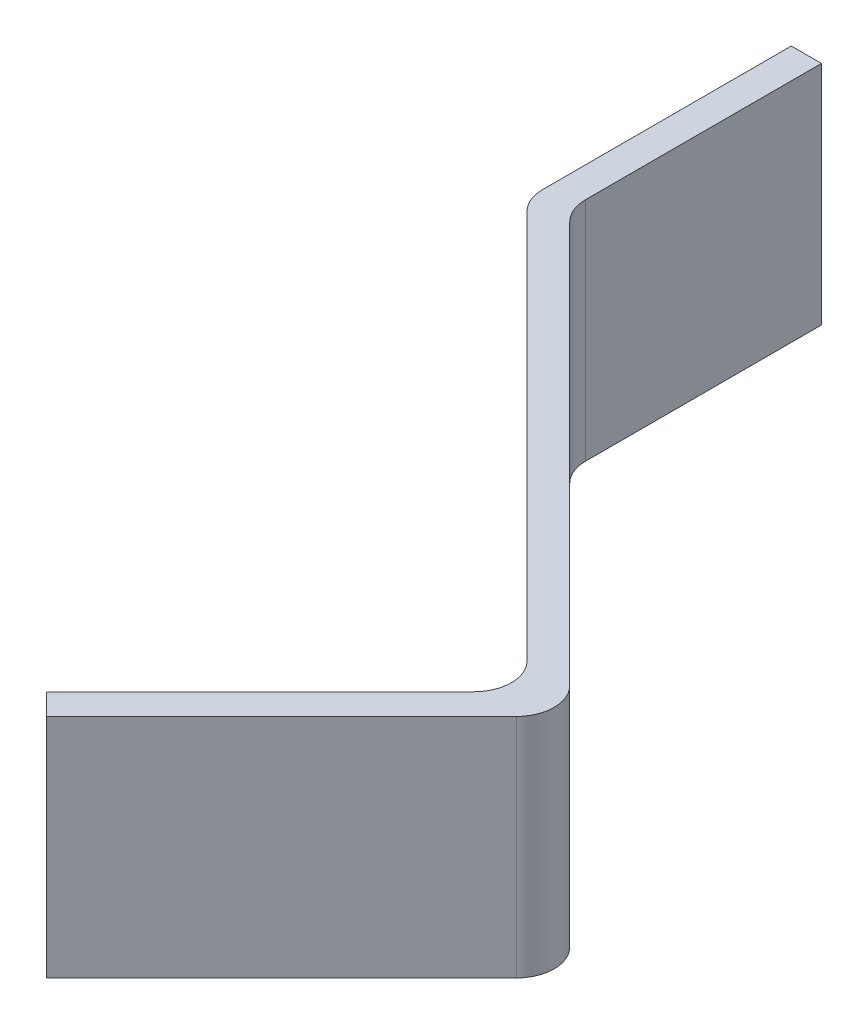
ISO-10303-21;
HEADER;
FILE_DESCRIPTION(('STEP AP214'),'2;1');
FILE_NAME('part.step','',(''),(''),'','','');
FILE_SCHEMA(('AUTOMOTIVE_DESIGN { 1 0 10303 214 1 1 1 1 }'));
ENDSEC;
DATA;
#1=APPLICATION_CONTEXT('core data for automotive mechanical design processes');
#2=APPLICATION_PROTOCOL_DEFINITION('international standard','automotive_design',2000,#1);
#3=PRODUCT_CONTEXT('',#1,'mechanical');
#4=PRODUCT('Part','Part','',(#3));
#5=PRODUCT_RELATED_PRODUCT_CATEGORY('part','',(#4));
#6=PRODUCT_DEFINITION_FORMATION('','',#4);
#7=PRODUCT_DEFINITION_CONTEXT('part definition',#1,'design');
#8=PRODUCT_DEFINITION('design','',#6,#7);
#9=PRODUCT_DEFINITION_SHAPE('','',#8);
#10=(LENGTH_UNIT() NAMED_UNIT(*) SI_UNIT(.MILLI.,.METRE.));
#11=(NAMED_UNIT(*) PLANE_ANGLE_UNIT() SI_UNIT($,.RADIAN.));
#12=(NAMED_UNIT(*) SI_UNIT($,.STERADIAN.) SOLID_ANGLE_UNIT());
#13=UNCERTAINTY_MEASURE_WITH_UNIT(LENGTH_MEASURE(1.E-05),#10,'distance_accuracy_value','');
#14=(GEOMETRIC_REPRESENTATION_CONTEXT(3) GLOBAL_UNCERTAINTY_ASSIGNED_CONTEXT((#13)) GLOBAL_UNIT_ASSIGNED_CONTEXT((#10,
#11,#12)) REPRESENTATION_CONTEXT('',''));
#15=CARTESIAN_POINT('',(0.,0.,0.));
#16=DIRECTION('',(0.,0.,1.));
#17=DIRECTION('',(1.,0.,0.));
#18=AXIS2_PLACEMENT_3D('',#15,#16,#17);
#19=CARTESIAN_POINT('',(245.256587827418,-22.5,-1.64112144396712));
#20=DIRECTION('',(0.,1.,0.));
#21=DIRECTION('',(0.,0.,1.));
#22=AXIS2_PLACEMENT_3D('',#19,#20,#21);
#23=CYLINDRICAL_SURFACE('',#22,4.99999999999998);
#24=CARTESIAN_POINT('',(245.256587827418,7.5,-1.64112144396712));
#25=DIRECTION('',(0.,1.,0.));
#26=DIRECTION('',(0.,0.,1.));
#27=AXIS2_PLACEMENT_3D('',#24,#25,#26);
#28=CIRCLE('',#27,4.99999999999998);
#29=CARTESIAN_POINT('',(248.79212173335,7.5,1.8944124619657));
#30=VERTEX_POINT('',#29);
#31=CARTESIAN_POINT('',(248.79212173335,7.5,-5.17665534989981));
#32=VERTEX_POINT('',#31);
#33=EDGE_CURVE('E154',#30,#32,#28,.T.);
#34=ORIENTED_EDGE('',*,*,#33,.F.);
#35=DIRECTION('',(0.,1.,0.));
#36=VECTOR('',#35,1.);
#37=CARTESIAN_POINT('',(248.79212173335,-22.5,1.8944124619657));
#38=LINE('',#37,#36);
#39=CARTESIAN_POINT('',(248.79212173335,-22.5,1.8944124619657));
#40=VERTEX_POINT('',#39);
#41=EDGE_CURVE('E11',#40,#30,#38,.T.);
#42=ORIENTED_EDGE('',*,*,#41,.F.);
#43=CARTESIAN_POINT('',(245.256587827418,-22.5,-1.64112144396712));
#44=DIRECTION('',(0.,1.,0.));
#45=DIRECTION('',(0.,0.,1.));
#46=AXIS2_PLACEMENT_3D('',#43,#44,#45);
#47=CIRCLE('',#46,4.99999999999998);
#48=CARTESIAN_POINT('',(248.79212173335,-22.5,-5.17665534989981));
#49=VERTEX_POINT('',#48);
#50=EDGE_CURVE('E186',#40,#49,#47,.T.);
#51=ORIENTED_EDGE('',*,*,#50,.T.);
#52=DIRECTION('',(0.,1.,0.));
#53=VECTOR('',#52,1.);
#54=CARTESIAN_POINT('',(248.79212173335,-22.5,-5.17665534989981));
#55=LINE('',#54,#53);
#56=EDGE_CURVE('E36',#49,#32,#55,.T.);
#57=ORIENTED_EDGE('',*,*,#56,.T.);
#58=EDGE_LOOP('',(#34,#42,#51,#57));
#59=FACE_BOUND('',#58,.T.);
#60=ADVANCED_FACE('F33',(#59),#23,.T.);
#61=CARTESIAN_POINT('',(217.679423361142,-22.5,33.007110834174));
#62=DIRECTION('',(0.70710678118655,0.,0.707106781186545));
#63=DIRECTION('',(0.707106781186545,0.,-0.70710678118655));
#64=AXIS2_PLACEMENT_3D('',#61,#62,#63);
#65=PLANE('',#64);
#66=DIRECTION('',(0.707106781186545,0.,-0.70710678118655));
#67=VECTOR('',#66,1.);
#68=CARTESIAN_POINT('',(217.679423361142,7.5,33.007110834174));
#69=LINE('',#68,#67);
#70=CARTESIAN_POINT('',(217.679423361142,7.5,33.007110834174));
#71=VERTEX_POINT('',#70);
#72=EDGE_CURVE('E184',#71,#30,#69,.T.);
#73=ORIENTED_EDGE('',*,*,#72,.F.);
#74=DIRECTION('',(0.,1.,0.));
#75=VECTOR('',#74,1.);
#76=CARTESIAN_POINT('',(217.679423361142,-22.5,33.007110834174));
#77=LINE('',#76,#75);
#78=CARTESIAN_POINT('',(217.679423361142,-22.5,33.007110834174));
#79=VERTEX_POINT('',#78);
#80=EDGE_CURVE('E42',#79,#71,#77,.T.);
#81=ORIENTED_EDGE('',*,*,#80,.F.);
#82=DIRECTION('',(0.707106781186545,0.,-0.70710678118655));
#83=VECTOR('',#82,1.);
#84=CARTESIAN_POINT('',(217.679423361142,-22.5,33.007110834174));
#85=LINE('',#84,#83);
#86=EDGE_CURVE('E144',#79,#40,#85,.T.);
#87=ORIENTED_EDGE('',*,*,#86,.T.);
#88=ORIENTED_EDGE('',*,*,#41,.T.);
#89=EDGE_LOOP('',(#73,#81,#87,#88));
#90=FACE_BOUND('',#89,.T.);
#91=ADVANCED_FACE('F206',(#90),#65,.T.);
#92=CARTESIAN_POINT('',(214.850996236396,-22.5,30.178683709427));
#93=DIRECTION('',(-0.707106781186648,0.,0.707106781186447));
#94=DIRECTION('',(0.707106781186447,0.,0.707106781186648));
#95=AXIS2_PLACEMENT_3D('',#92,#93,#94);
#96=PLANE('',#95);
#97=DIRECTION('',(0.707106781186447,0.,0.707106781186648));
#98=VECTOR('',#97,1.);
#99=CARTESIAN_POINT('',(214.850996236396,7.5,30.178683709427));
#100=LINE('',#99,#98);
#101=CARTESIAN_POINT('',(214.850996236396,7.5,30.178683709427));
#102=VERTEX_POINT('',#101);
#103=EDGE_CURVE('E131',#102,#71,#100,.T.);
#104=ORIENTED_EDGE('',*,*,#103,.F.);
#105=DIRECTION('',(0.,1.,0.));
#106=VECTOR('',#105,1.);
#107=CARTESIAN_POINT('',(214.850996236396,-22.5,30.178683709427));
#108=LINE('',#107,#106);
#109=CARTESIAN_POINT('',(214.850996236396,-22.5,30.178683709427));
#110=VERTEX_POINT('',#109);
#111=EDGE_CURVE('E126',#110,#102,#108,.T.);
#112=ORIENTED_EDGE('',*,*,#111,.F.);
#113=DIRECTION('',(0.707106781186447,0.,0.707106781186648));
#114=VECTOR('',#113,1.);
#115=CARTESIAN_POINT('',(214.850996236396,-22.5,30.178683709427));
#116=LINE('',#115,#114);
#117=EDGE_CURVE('E129',#110,#79,#116,.T.);
#118=ORIENTED_EDGE('',*,*,#117,.T.);
#119=ORIENTED_EDGE('',*,*,#80,.T.);
#120=EDGE_LOOP('',(#104,#112,#118,#119));
#121=FACE_BOUND('',#120,.T.);
#122=ADVANCED_FACE('F128',(#121),#96,.T.);
#123=CARTESIAN_POINT('',(243.135267483858,-22.5,1.8944124619656));
#124=DIRECTION('',(-0.707106781186541,0.,-0.707106781186554));
#125=DIRECTION('',(-0.707106781186554,0.,0.707106781186541));
#126=AXIS2_PLACEMENT_3D('',#123,#124,#125);
#127=PLANE('',#126);
#128=DIRECTION('',(-0.707106781186554,0.,0.707106781186541));
#129=VECTOR('',#128,1.);
#130=CARTESIAN_POINT('',(243.135267483858,7.5,1.8944124619656));
#131=LINE('',#130,#129);
#132=CARTESIAN_POINT('',(243.135267483858,7.5,1.8944124619656));
#133=VERTEX_POINT('',#132);
#134=EDGE_CURVE('E181',#133,#102,#131,.T.);
#135=ORIENTED_EDGE('',*,*,#134,.F.);
#136=DIRECTION('',(0.,1.,0.));
#137=VECTOR('',#136,1.);
#138=CARTESIAN_POINT('',(243.135267483858,-22.5,1.8944124619656));
#139=LINE('',#138,#137);
#140=CARTESIAN_POINT('',(243.135267483858,-22.5,1.8944124619656));
#141=VERTEX_POINT('',#140);
#142=EDGE_CURVE('E136',#141,#133,#139,.T.);
#143=ORIENTED_EDGE('',*,*,#142,.F.);
#144=DIRECTION('',(-0.707106781186554,0.,0.707106781186541));
#145=VECTOR('',#144,1.);
#146=CARTESIAN_POINT('',(243.135267483858,-22.5,1.8944124619656));
#147=LINE('',#146,#145);
#148=EDGE_CURVE('E142',#141,#110,#147,.T.);
#149=ORIENTED_EDGE('',*,*,#148,.T.);
#150=ORIENTED_EDGE('',*,*,#111,.T.);
#151=EDGE_LOOP('',(#135,#143,#149,#150));
#152=FACE_BOUND('',#151,.T.);
#153=ADVANCED_FACE('F146',(#152),#127,.T.);
#154=CARTESIAN_POINT('',(239.599733577925,-22.5,-1.64112144396712));
#155=DIRECTION('',(0.,1.,0.));
#156=DIRECTION('',(0.,0.,1.));
#157=AXIS2_PLACEMENT_3D('',#154,#155,#156);
#158=CYLINDRICAL_SURFACE('',#157,4.99999999999998);
#159=CARTESIAN_POINT('',(239.599733577925,7.5,-1.64112144396712));
#160=DIRECTION('',(0.,-1.,0.));
#161=DIRECTION('',(0.,0.,1.));
#162=AXIS2_PLACEMENT_3D('',#159,#160,#161);
#163=CIRCLE('',#162,4.99999999999998);
#164=CARTESIAN_POINT('',(243.135267483858,7.5,-5.1766553498998));
#165=VERTEX_POINT('',#164);
#166=EDGE_CURVE('E178',#165,#133,#163,.T.);
#167=ORIENTED_EDGE('',*,*,#166,.F.);
#168=DIRECTION('',(0.,1.,0.));
#169=VECTOR('',#168,1.);
#170=CARTESIAN_POINT('',(243.135267483858,-22.5,-5.1766553498998));
#171=LINE('',#170,#169);
#172=CARTESIAN_POINT('',(243.135267483858,-22.5,-5.1766553498998));
#173=VERTEX_POINT('',#172);
#174=EDGE_CURVE('E190',#173,#165,#171,.T.);
#175=ORIENTED_EDGE('',*,*,#174,.F.);
#176=CARTESIAN_POINT('',(239.599733577925,-22.5,-1.64112144396712));
#177=DIRECTION('',(0.,-1.,0.));
#178=DIRECTION('',(0.,0.,1.));
#179=AXIS2_PLACEMENT_3D('',#176,#177,#178);
#180=CIRCLE('',#179,4.99999999999998);
#181=EDGE_CURVE('E147',#173,#141,#180,.T.);
#182=ORIENTED_EDGE('',*,*,#181,.T.);
#183=ORIENTED_EDGE('',*,*,#142,.T.);
#184=EDGE_LOOP('',(#167,#175,#182,#183));
#185=FACE_BOUND('',#184,.T.);
#186=ADVANCED_FACE('F219',(#185),#158,.F.);
#187=CARTESIAN_POINT('',(191.566724988934,-22.5,-56.7451978448237));
#188=DIRECTION('',(-0.707106781186548,0.,0.707106781186546));
#189=DIRECTION('',(0.707106781186547,0.,0.707106781186549));
#190=AXIS2_PLACEMENT_3D('',#187,#188,#189);
#191=PLANE('',#190);
#192=DIRECTION('',(0.707106781186547,0.,0.707106781186549));
#193=VECTOR('',#192,1.);
#194=CARTESIAN_POINT('',(191.566724988934,7.5,-56.7451978448237));
#195=LINE('',#194,#193);
#196=CARTESIAN_POINT('',(191.566724988934,7.5,-56.7451978448237));
#197=VERTEX_POINT('',#196);
#198=EDGE_CURVE('E175',#197,#165,#195,.T.);
#199=ORIENTED_EDGE('',*,*,#198,.F.);
#200=DIRECTION('',(0.,1.,0.));
#201=VECTOR('',#200,1.);
#202=CARTESIAN_POINT('',(191.566724988934,-22.5,-56.7451978448237));
#203=LINE('',#202,#201);
#204=CARTESIAN_POINT('',(191.566724988934,-22.5,-56.7451978448237));
#205=VERTEX_POINT('',#204);
#206=EDGE_CURVE('E192',#205,#197,#203,.T.);
#207=ORIENTED_EDGE('',*,*,#206,.F.);
#208=DIRECTION('',(0.707106781186547,0.,0.707106781186549));
#209=VECTOR('',#208,1.);
#210=CARTESIAN_POINT('',(191.566724988934,-22.5,-56.7451978448237));
#211=LINE('',#210,#209);
#212=EDGE_CURVE('E149',#205,#173,#211,.T.);
#213=ORIENTED_EDGE('',*,*,#212,.T.);
#214=ORIENTED_EDGE('',*,*,#174,.T.);
#215=EDGE_LOOP('',(#199,#207,#213,#214));
#216=FACE_BOUND('',#215,.T.);
#217=ADVANCED_FACE('F222',(#216),#191,.T.);
#218=CARTESIAN_POINT('',(195.102258894867,-22.5,-60.2807317507565));
#219=DIRECTION('',(0.,1.,0.));
#220=DIRECTION('',(0.,0.,1.));
#221=AXIS2_PLACEMENT_3D('',#218,#219,#220);
#222=CYLINDRICAL_SURFACE('',#221,5.00000000000003);
#223=CARTESIAN_POINT('',(195.102258894867,7.5,-60.2807317507565));
#224=DIRECTION('',(0.,1.,0.));
#225=DIRECTION('',(0.,0.,1.));
#226=AXIS2_PLACEMENT_3D('',#223,#224,#225);
#227=CIRCLE('',#226,5.00000000000003);
#228=CARTESIAN_POINT('',(190.102258894867,7.5,-60.2807317507565));
#229=VERTEX_POINT('',#228);
#230=EDGE_CURVE('E172',#229,#197,#227,.T.);
#231=ORIENTED_EDGE('',*,*,#230,.F.);
#232=DIRECTION('',(0.,1.,0.));
#233=VECTOR('',#232,1.);
#234=CARTESIAN_POINT('',(190.102258894867,-22.5,-60.2807317507565));
#235=LINE('',#234,#233);
#236=CARTESIAN_POINT('',(190.102258894867,-22.5,-60.2807317507565));
#237=VERTEX_POINT('',#236);
#238=EDGE_CURVE('E194',#237,#229,#235,.T.);
#239=ORIENTED_EDGE('',*,*,#238,.F.);
#240=CARTESIAN_POINT('',(195.102258894867,-22.5,-60.2807317507565));
#241=DIRECTION('',(0.,1.,0.));
#242=DIRECTION('',(0.,0.,1.));
#243=AXIS2_PLACEMENT_3D('',#240,#241,#242);
#244=CIRCLE('',#243,5.00000000000003);
#245=EDGE_CURVE('E348',#237,#205,#244,.T.);
#246=ORIENTED_EDGE('',*,*,#245,.T.);
#247=ORIENTED_EDGE('',*,*,#206,.T.);
#248=EDGE_LOOP('',(#231,#239,#246,#247));
#249=FACE_BOUND('',#248,.T.);
#250=ADVANCED_FACE('F226',(#249),#222,.T.);
#251=CARTESIAN_POINT('',(190.102258894867,-22.5,-93.209663938891));
#252=DIRECTION('',(-1.,0.,0.));
#253=DIRECTION('',(0.,0.,1.));
#254=AXIS2_PLACEMENT_3D('',#251,#252,#253);
#255=PLANE('',#254);
#256=DIRECTION('',(0.,0.,1.));
#257=VECTOR('',#256,1.);
#258=CARTESIAN_POINT('',(190.102258894867,7.5,-93.209663938891));
#259=LINE('',#258,#257);
#260=CARTESIAN_POINT('',(190.102258894867,7.5,-93.209663938891));
#261=VERTEX_POINT('',#260);
#262=EDGE_CURVE('E169',#261,#229,#259,.T.);
#263=ORIENTED_EDGE('',*,*,#262,.F.);
#264=DIRECTION('',(0.,1.,0.));
#265=VECTOR('',#264,1.);
#266=CARTESIAN_POINT('',(190.102258894867,-22.5,-93.209663938891));
#267=LINE('',#266,#265);
#268=CARTESIAN_POINT('',(190.102258894867,-22.5,-93.209663938891));
#269=VERTEX_POINT('',#268);
#270=EDGE_CURVE('E196',#269,#261,#267,.T.);
#271=ORIENTED_EDGE('',*,*,#270,.F.);
#272=DIRECTION('',(0.,0.,1.));
#273=VECTOR('',#272,1.);
#274=CARTESIAN_POINT('',(190.102258894867,-22.5,-93.209663938891));
#275=LINE('',#274,#273);
#276=EDGE_CURVE('E352',#269,#237,#275,.T.);
#277=ORIENTED_EDGE('',*,*,#276,.T.);
#278=ORIENTED_EDGE('',*,*,#238,.T.);
#279=EDGE_LOOP('',(#263,#271,#277,#278));
#280=FACE_BOUND('',#279,.T.);
#281=ADVANCED_FACE('F230',(#280),#255,.T.);
#282=CARTESIAN_POINT('',(194.102258894867,-22.5,-93.209663938891));
#283=DIRECTION('',(0.,0.,-1.));
#284=DIRECTION('',(-1.,0.,0.));
#285=AXIS2_PLACEMENT_3D('',#282,#283,#284);
#286=PLANE('',#285);
#287=DIRECTION('',(-1.,0.,0.));
#288=VECTOR('',#287,1.);
#289=CARTESIAN_POINT('',(194.102258894867,7.5,-93.209663938891));
#290=LINE('',#289,#288);
#291=CARTESIAN_POINT('',(194.102258894867,7.5,-93.209663938891));
#292=VERTEX_POINT('',#291);
#293=EDGE_CURVE('E166',#292,#261,#290,.T.);
#294=ORIENTED_EDGE('',*,*,#293,.F.);
#295=DIRECTION('',(0.,1.,0.));
#296=VECTOR('',#295,1.);
#297=CARTESIAN_POINT('',(194.102258894867,-22.5,-93.209663938891));
#298=LINE('',#297,#296);
#299=CARTESIAN_POINT('',(194.102258894867,-22.5,-93.209663938891));
#300=VERTEX_POINT('',#299);
#301=EDGE_CURVE('E198',#300,#292,#298,.T.);
#302=ORIENTED_EDGE('',*,*,#301,.F.);
#303=DIRECTION('',(-1.,0.,0.));
#304=VECTOR('',#303,1.);
#305=CARTESIAN_POINT('',(194.102258894867,-22.5,-93.209663938891));
#306=LINE('',#305,#304);
#307=EDGE_CURVE('E341',#300,#269,#306,.T.);
#308=ORIENTED_EDGE('',*,*,#307,.T.);
#309=ORIENTED_EDGE('',*,*,#270,.T.);
#310=EDGE_LOOP('',(#294,#302,#308,#309));
#311=FACE_BOUND('',#310,.T.);
#312=ADVANCED_FACE('F234',(#311),#286,.T.);
#313=CARTESIAN_POINT('',(194.102258894867,-22.5,-61.9375860002488));
#314=DIRECTION('',(1.,0.,0.));
#315=DIRECTION('',(0.,0.,-1.));
#316=AXIS2_PLACEMENT_3D('',#313,#314,#315);
#317=PLANE('',#316);
#318=DIRECTION('',(0.,0.,-1.));
#319=VECTOR('',#318,1.);
#320=CARTESIAN_POINT('',(194.102258894867,7.5,-61.9375860002488));
#321=LINE('',#320,#319);
#322=CARTESIAN_POINT('',(194.102258894867,7.5,-61.9375860002488));
#323=VERTEX_POINT('',#322);
#324=EDGE_CURVE('E163',#323,#292,#321,.T.);
#325=ORIENTED_EDGE('',*,*,#324,.F.);
#326=DIRECTION('',(0.,1.,0.));
#327=VECTOR('',#326,1.);
#328=CARTESIAN_POINT('',(194.102258894867,-22.5,-61.9375860002488));
#329=LINE('',#328,#327);
#330=CARTESIAN_POINT('',(194.102258894867,-22.5,-61.9375860002488));
#331=VERTEX_POINT('',#330);
#332=EDGE_CURVE('E200',#331,#323,#329,.T.);
#333=ORIENTED_EDGE('',*,*,#332,.F.);
#334=DIRECTION('',(0.,0.,-1.));
#335=VECTOR('',#334,1.);
#336=CARTESIAN_POINT('',(194.102258894867,-22.5,-61.9375860002488));
#337=LINE('',#336,#335);
#338=EDGE_CURVE('E337',#331,#300,#337,.T.);
#339=ORIENTED_EDGE('',*,*,#338,.T.);
#340=ORIENTED_EDGE('',*,*,#301,.T.);
#341=EDGE_LOOP('',(#325,#333,#339,#340));
#342=FACE_BOUND('',#341,.T.);
#343=ADVANCED_FACE('F238',(#342),#317,.T.);
#344=CARTESIAN_POINT('',(199.102258894867,-22.5,-61.9375860002488));
#345=DIRECTION('',(0.,1.,0.));
#346=DIRECTION('',(0.,0.,1.));
#347=AXIS2_PLACEMENT_3D('',#344,#345,#346);
#348=CYLINDRICAL_SURFACE('',#347,4.99999999999999);
#349=CARTESIAN_POINT('',(199.102258894867,7.5,-61.9375860002488));
#350=DIRECTION('',(0.,-1.,0.));
#351=DIRECTION('',(0.,0.,1.));
#352=AXIS2_PLACEMENT_3D('',#349,#350,#351);
#353=CIRCLE('',#352,4.99999999999999);
#354=CARTESIAN_POINT('',(195.566724988934,7.5,-58.4020520943161));
#355=VERTEX_POINT('',#354);
#356=EDGE_CURVE('E160',#355,#323,#353,.T.);
#357=ORIENTED_EDGE('',*,*,#356,.F.);
#358=DIRECTION('',(0.,1.,0.));
#359=VECTOR('',#358,1.);
#360=CARTESIAN_POINT('',(195.566724988934,-22.5,-58.4020520943161));
#361=LINE('',#360,#359);
#362=CARTESIAN_POINT('',(195.566724988934,-22.5,-58.4020520943161));
#363=VERTEX_POINT('',#362);
#364=EDGE_CURVE('E201',#363,#355,#361,.T.);
#365=ORIENTED_EDGE('',*,*,#364,.F.);
#366=CARTESIAN_POINT('',(199.102258894867,-22.5,-61.9375860002488));
#367=DIRECTION('',(0.,-1.,0.));
#368=DIRECTION('',(0.,0.,1.));
#369=AXIS2_PLACEMENT_3D('',#366,#367,#368);
#370=CIRCLE('',#369,4.99999999999999);
#371=EDGE_CURVE('E358',#363,#331,#370,.T.);
#372=ORIENTED_EDGE('',*,*,#371,.T.);
#373=ORIENTED_EDGE('',*,*,#332,.T.);
#374=EDGE_LOOP('',(#357,#365,#372,#373));
#375=FACE_BOUND('',#374,.T.);
#376=ADVANCED_FACE('F242',(#375),#348,.F.);
#377=CARTESIAN_POINT('',(248.79212173335,-22.5,-5.17665534989981));
#378=DIRECTION('',(0.707106781186549,0.,-0.707106781186546));
#379=DIRECTION('',(-0.707106781186546,0.,-0.707106781186549));
#380=AXIS2_PLACEMENT_3D('',#377,#378,#379);
#381=PLANE('',#380);
#382=DIRECTION('',(-0.707106781186546,0.,-0.707106781186549));
#383=VECTOR('',#382,1.);
#384=CARTESIAN_POINT('',(248.79212173335,7.5,-5.17665534989981));
#385=LINE('',#384,#383);
#386=EDGE_CURVE('E157',#32,#355,#385,.T.);
#387=ORIENTED_EDGE('',*,*,#386,.F.);
#388=ORIENTED_EDGE('',*,*,#56,.F.);
#389=DIRECTION('',(-0.707106781186546,0.,-0.707106781186549));
#390=VECTOR('',#389,1.);
#391=CARTESIAN_POINT('',(248.79212173335,-22.5,-5.17665534989981));
#392=LINE('',#391,#390);
#393=EDGE_CURVE('E360',#49,#363,#392,.T.);
#394=ORIENTED_EDGE('',*,*,#393,.T.);
#395=ORIENTED_EDGE('',*,*,#364,.T.);
#396=EDGE_LOOP('',(#387,#388,#394,#395));
#397=FACE_BOUND('',#396,.T.);
#398=ADVANCED_FACE('F203',(#397),#381,.T.);
#399=CARTESIAN_POINT('',(245.256587827418,-22.5,-1.64112144396712));
#400=DIRECTION('',(0.,1.,0.));
#401=DIRECTION('',(0.,0.,1.));
#402=AXIS2_PLACEMENT_3D('',#399,#400,#401);
#403=PLANE('',#402);
#404=ORIENTED_EDGE('',*,*,#50,.F.);
#405=ORIENTED_EDGE('',*,*,#86,.F.);
#406=ORIENTED_EDGE('',*,*,#117,.F.);
#407=ORIENTED_EDGE('',*,*,#148,.F.);
#408=ORIENTED_EDGE('',*,*,#181,.F.);
#409=ORIENTED_EDGE('',*,*,#212,.F.);
#410=ORIENTED_EDGE('',*,*,#245,.F.);
#411=ORIENTED_EDGE('',*,*,#276,.F.);
#412=ORIENTED_EDGE('',*,*,#307,.F.);
#413=ORIENTED_EDGE('',*,*,#338,.F.);
#414=ORIENTED_EDGE('',*,*,#371,.F.);
#415=ORIENTED_EDGE('',*,*,#393,.F.);
#416=EDGE_LOOP('',(#404,#405,#406,#407,#408,#409,#410,#411,#412,#413,#414,#415));
#417=FACE_BOUND('',#416,.T.);
#418=ADVANCED_FACE('F140',(#417),#403,.F.);
#419=CARTESIAN_POINT('',(245.256587827418,7.5,-1.64112144396712));
#420=DIRECTION('',(0.,1.,0.));
#421=DIRECTION('',(0.,0.,1.));
#422=AXIS2_PLACEMENT_3D('',#419,#420,#421);
#423=PLANE('',#422);
#424=ORIENTED_EDGE('',*,*,#33,.T.);
#425=ORIENTED_EDGE('',*,*,#386,.T.);
#426=ORIENTED_EDGE('',*,*,#356,.T.);
#427=ORIENTED_EDGE('',*,*,#324,.T.);
#428=ORIENTED_EDGE('',*,*,#293,.T.);
#429=ORIENTED_EDGE('',*,*,#262,.T.);
#430=ORIENTED_EDGE('',*,*,#230,.T.);
#431=ORIENTED_EDGE('',*,*,#198,.T.);
#432=ORIENTED_EDGE('',*,*,#166,.T.);
#433=ORIENTED_EDGE('',*,*,#134,.T.);
#434=ORIENTED_EDGE('',*,*,#103,.T.);
#435=ORIENTED_EDGE('',*,*,#72,.T.);
#436=EDGE_LOOP('',(#424,#425,#426,#427,#428,#429,#430,#431,#432,#433,#434,#435));
#437=FACE_BOUND('',#436,.T.);
#438=ADVANCED_FACE('F205',(#437),#423,.T.);
#439=CLOSED_SHELL('',(#60,#91,#122,#153,#186,#217,#250,#281,#312,#343,#376,#398,#418,#438));
#440=MANIFOLD_SOLID_BREP('B2',#439);
#441=ADVANCED_BREP_SHAPE_REPRESENTATION('',(#18,#440),#14);
#442=SHAPE_DEFINITION_REPRESENTATION(#9,#441);
ENDSEC;
END-ISO-10303-21;
